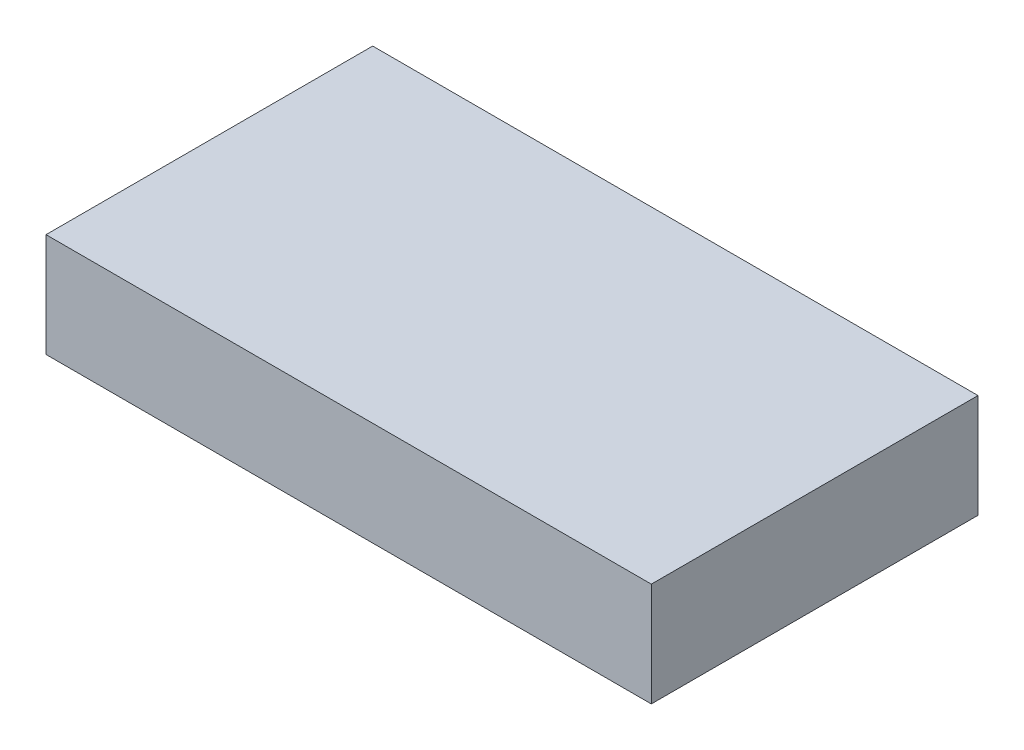
ISO-10303-21;
HEADER;
FILE_DESCRIPTION(('STEP AP214'),'2;1');
FILE_NAME('part.step','',(''),(''),'','','');
FILE_SCHEMA(('AUTOMOTIVE_DESIGN { 1 0 10303 214 1 1 1 1 }'));
ENDSEC;
DATA;
#1=APPLICATION_CONTEXT('core data for automotive mechanical design processes');
#2=APPLICATION_PROTOCOL_DEFINITION('international standard','automotive_design',2000,#1);
#3=PRODUCT_CONTEXT('',#1,'mechanical');
#4=PRODUCT('Part','Part','',(#3));
#5=PRODUCT_RELATED_PRODUCT_CATEGORY('part','',(#4));
#6=PRODUCT_DEFINITION_FORMATION('','',#4);
#7=PRODUCT_DEFINITION_CONTEXT('part definition',#1,'design');
#8=PRODUCT_DEFINITION('design','',#6,#7);
#9=PRODUCT_DEFINITION_SHAPE('','',#8);
#10=(LENGTH_UNIT() NAMED_UNIT(*) SI_UNIT(.MILLI.,.METRE.));
#11=(NAMED_UNIT(*) PLANE_ANGLE_UNIT() SI_UNIT($,.RADIAN.));
#12=(NAMED_UNIT(*) SI_UNIT($,.STERADIAN.) SOLID_ANGLE_UNIT());
#13=UNCERTAINTY_MEASURE_WITH_UNIT(LENGTH_MEASURE(1.E-05),#10,'distance_accuracy_value','');
#14=(GEOMETRIC_REPRESENTATION_CONTEXT(3) GLOBAL_UNCERTAINTY_ASSIGNED_CONTEXT((#13)) GLOBAL_UNIT_ASSIGNED_CONTEXT((#10,
#11,#12)) REPRESENTATION_CONTEXT('',''));
#15=CARTESIAN_POINT('',(0.,0.,0.));
#16=DIRECTION('',(0.,0.,1.));
#17=DIRECTION('',(1.,0.,0.));
#18=AXIS2_PLACEMENT_3D('',#15,#16,#17);
#19=CARTESIAN_POINT('',(0.,2.7,0.));
#20=DIRECTION('',(1.,0.,0.));
#21=DIRECTION('',(0.,0.,-1.));
#22=AXIS2_PLACEMENT_3D('',#19,#20,#21);
#23=PLANE('',#22);
#24=DIRECTION('',(0.,0.,1.));
#25=VECTOR('',#24,1.);
#26=CARTESIAN_POINT('',(0.,0.,0.));
#27=LINE('',#26,#25);
#28=CARTESIAN_POINT('',(0.,0.,-8.49999999999999));
#29=VERTEX_POINT('',#28);
#30=CARTESIAN_POINT('',(0.,0.,0.));
#31=VERTEX_POINT('',#30);
#32=EDGE_CURVE('E95',#29,#31,#27,.T.);
#33=ORIENTED_EDGE('',*,*,#32,.T.);
#34=DIRECTION('',(0.,-1.,0.));
#35=VECTOR('',#34,1.);
#36=CARTESIAN_POINT('',(0.,2.7,0.));
#37=LINE('',#36,#35);
#38=CARTESIAN_POINT('',(0.,2.7,0.));
#39=VERTEX_POINT('',#38);
#40=EDGE_CURVE('E11',#39,#31,#37,.T.);
#41=ORIENTED_EDGE('',*,*,#40,.F.);
#42=DIRECTION('',(0.,0.,1.));
#43=VECTOR('',#42,1.);
#44=CARTESIAN_POINT('',(0.,2.7,0.));
#45=LINE('',#44,#43);
#46=CARTESIAN_POINT('',(0.,2.7,-8.49999999999999));
#47=VERTEX_POINT('',#46);
#48=EDGE_CURVE('E83',#47,#39,#45,.T.);
#49=ORIENTED_EDGE('',*,*,#48,.F.);
#50=DIRECTION('',(0.,-1.,0.));
#51=VECTOR('',#50,1.);
#52=CARTESIAN_POINT('',(0.,2.7,-8.49999999999999));
#53=LINE('',#52,#51);
#54=EDGE_CURVE('E91',#47,#29,#53,.T.);
#55=ORIENTED_EDGE('',*,*,#54,.T.);
#56=EDGE_LOOP('',(#33,#41,#49,#55));
#57=FACE_BOUND('',#56,.T.);
#58=ADVANCED_FACE('F32',(#57),#23,.F.);
#59=CARTESIAN_POINT('',(0.,2.7,0.));
#60=DIRECTION('',(0.,0.,-1.));
#61=DIRECTION('',(-1.,0.,0.));
#62=AXIS2_PLACEMENT_3D('',#59,#60,#61);
#63=PLANE('',#62);
#64=DIRECTION('',(1.,0.,0.));
#65=VECTOR('',#64,1.);
#66=CARTESIAN_POINT('',(0.,0.,0.));
#67=LINE('',#66,#65);
#68=CARTESIAN_POINT('',(15.75,0.,0.));
#69=VERTEX_POINT('',#68);
#70=EDGE_CURVE('E87',#31,#69,#67,.T.);
#71=ORIENTED_EDGE('',*,*,#70,.T.);
#72=DIRECTION('',(0.,-1.,0.));
#73=VECTOR('',#72,1.);
#74=CARTESIAN_POINT('',(15.75,2.7,0.));
#75=LINE('',#74,#73);
#76=CARTESIAN_POINT('',(15.75,2.7,0.));
#77=VERTEX_POINT('',#76);
#78=EDGE_CURVE('E40',#77,#69,#75,.T.);
#79=ORIENTED_EDGE('',*,*,#78,.F.);
#80=DIRECTION('',(1.,0.,0.));
#81=VECTOR('',#80,1.);
#82=CARTESIAN_POINT('',(0.,2.7,0.));
#83=LINE('',#82,#81);
#84=EDGE_CURVE('E78',#39,#77,#83,.T.);
#85=ORIENTED_EDGE('',*,*,#84,.F.);
#86=ORIENTED_EDGE('',*,*,#40,.T.);
#87=EDGE_LOOP('',(#71,#79,#85,#86));
#88=FACE_BOUND('',#87,.T.);
#89=ADVANCED_FACE('F86',(#88),#63,.F.);
#90=CARTESIAN_POINT('',(15.75,2.7,0.));
#91=DIRECTION('',(-1.,0.,0.));
#92=DIRECTION('',(0.,0.,1.));
#93=AXIS2_PLACEMENT_3D('',#90,#91,#92);
#94=PLANE('',#93);
#95=DIRECTION('',(0.,0.,-1.));
#96=VECTOR('',#95,1.);
#97=CARTESIAN_POINT('',(15.75,0.,0.));
#98=LINE('',#97,#96);
#99=CARTESIAN_POINT('',(15.75,0.,-8.49999999999999));
#100=VERTEX_POINT('',#99);
#101=EDGE_CURVE('E65',#69,#100,#98,.T.);
#102=ORIENTED_EDGE('',*,*,#101,.T.);
#103=DIRECTION('',(0.,-1.,0.));
#104=VECTOR('',#103,1.);
#105=CARTESIAN_POINT('',(15.75,2.7,-8.49999999999999));
#106=LINE('',#105,#104);
#107=CARTESIAN_POINT('',(15.75,2.7,-8.49999999999999));
#108=VERTEX_POINT('',#107);
#109=EDGE_CURVE('E88',#108,#100,#106,.T.);
#110=ORIENTED_EDGE('',*,*,#109,.F.);
#111=DIRECTION('',(0.,0.,-1.));
#112=VECTOR('',#111,1.);
#113=CARTESIAN_POINT('',(15.75,2.7,0.));
#114=LINE('',#113,#112);
#115=EDGE_CURVE('E81',#77,#108,#114,.T.);
#116=ORIENTED_EDGE('',*,*,#115,.F.);
#117=ORIENTED_EDGE('',*,*,#78,.T.);
#118=EDGE_LOOP('',(#102,#110,#116,#117));
#119=FACE_BOUND('',#118,.T.);
#120=ADVANCED_FACE('F89',(#119),#94,.F.);
#121=CARTESIAN_POINT('',(0.,2.7,-8.49999999999999));
#122=DIRECTION('',(0.,0.,1.));
#123=DIRECTION('',(1.,0.,0.));
#124=AXIS2_PLACEMENT_3D('',#121,#122,#123);
#125=PLANE('',#124);
#126=DIRECTION('',(-1.,0.,0.));
#127=VECTOR('',#126,1.);
#128=CARTESIAN_POINT('',(0.,0.,-8.49999999999999));
#129=LINE('',#128,#127);
#130=EDGE_CURVE('E71',#100,#29,#129,.T.);
#131=ORIENTED_EDGE('',*,*,#130,.T.);
#132=ORIENTED_EDGE('',*,*,#54,.F.);
#133=DIRECTION('',(-1.,0.,0.));
#134=VECTOR('',#133,1.);
#135=CARTESIAN_POINT('',(0.,2.7,-8.49999999999999));
#136=LINE('',#135,#134);
#137=EDGE_CURVE('E48',#108,#47,#136,.T.);
#138=ORIENTED_EDGE('',*,*,#137,.F.);
#139=ORIENTED_EDGE('',*,*,#109,.T.);
#140=EDGE_LOOP('',(#131,#132,#138,#139));
#141=FACE_BOUND('',#140,.T.);
#142=ADVANCED_FACE('F102',(#141),#125,.F.);
#143=CARTESIAN_POINT('',(0.,2.7,0.));
#144=DIRECTION('',(0.,-1.,0.));
#145=DIRECTION('',(0.,0.,-1.));
#146=AXIS2_PLACEMENT_3D('',#143,#144,#145);
#147=PLANE('',#146);
#148=ORIENTED_EDGE('',*,*,#48,.T.);
#149=ORIENTED_EDGE('',*,*,#84,.T.);
#150=ORIENTED_EDGE('',*,*,#115,.T.);
#151=ORIENTED_EDGE('',*,*,#137,.T.);
#152=EDGE_LOOP('',(#148,#149,#150,#151));
#153=FACE_BOUND('',#152,.T.);
#154=ADVANCED_FACE('F79',(#153),#147,.F.);
#155=CARTESIAN_POINT('',(0.,0.,0.));
#156=DIRECTION('',(0.,-1.,0.));
#157=DIRECTION('',(0.,0.,-1.));
#158=AXIS2_PLACEMENT_3D('',#155,#156,#157);
#159=PLANE('',#158);
#160=ORIENTED_EDGE('',*,*,#32,.F.);
#161=ORIENTED_EDGE('',*,*,#130,.F.);
#162=ORIENTED_EDGE('',*,*,#101,.F.);
#163=ORIENTED_EDGE('',*,*,#70,.F.);
#164=EDGE_LOOP('',(#160,#161,#162,#163));
#165=FACE_BOUND('',#164,.T.);
#166=ADVANCED_FACE('F105',(#165),#159,.T.);
#167=CLOSED_SHELL('',(#58,#89,#120,#142,#154,#166));
#168=MANIFOLD_SOLID_BREP('B2',#167);
#169=ADVANCED_BREP_SHAPE_REPRESENTATION('',(#18,#168),#14);
#170=SHAPE_DEFINITION_REPRESENTATION(#9,#169);
ENDSEC;
END-ISO-10303-21;
